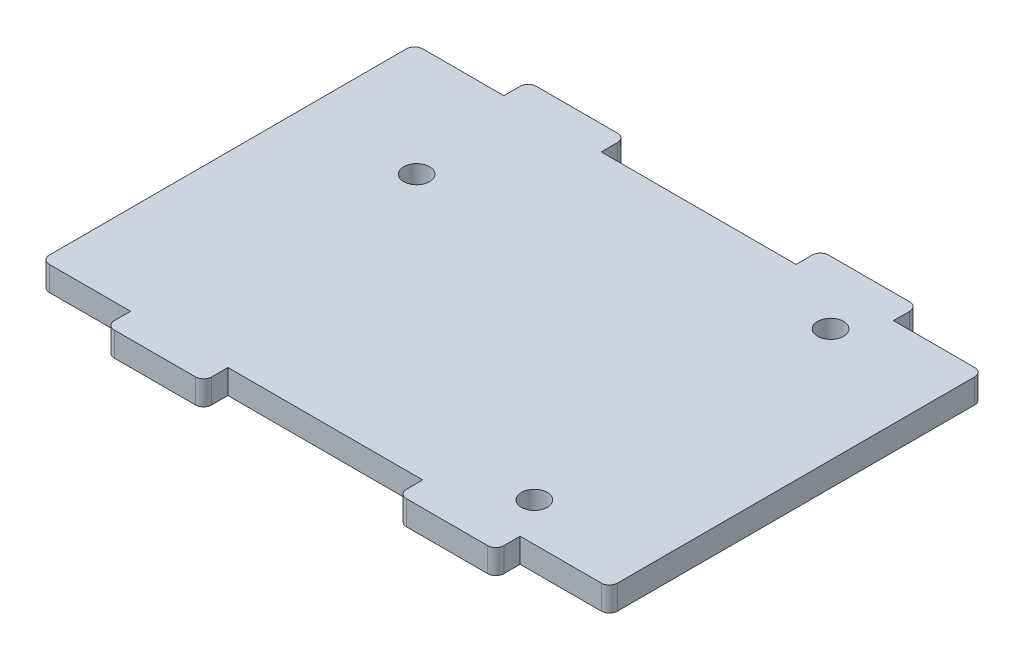
ISO-10303-21;
HEADER;
FILE_DESCRIPTION(('STEP AP214'),'2;1');
FILE_NAME('part.step','',(''),(''),'','','');
FILE_SCHEMA(('AUTOMOTIVE_DESIGN { 1 0 10303 214 1 1 1 1 }'));
ENDSEC;
DATA;
#1=APPLICATION_CONTEXT('core data for automotive mechanical design processes');
#2=APPLICATION_PROTOCOL_DEFINITION('international standard','automotive_design',2000,#1);
#3=PRODUCT_CONTEXT('',#1,'mechanical');
#4=PRODUCT('Part','Part','',(#3));
#5=PRODUCT_RELATED_PRODUCT_CATEGORY('part','',(#4));
#6=PRODUCT_DEFINITION_FORMATION('','',#4);
#7=PRODUCT_DEFINITION_CONTEXT('part definition',#1,'design');
#8=PRODUCT_DEFINITION('design','',#6,#7);
#9=PRODUCT_DEFINITION_SHAPE('','',#8);
#10=(LENGTH_UNIT() NAMED_UNIT(*) SI_UNIT(.MILLI.,.METRE.));
#11=(NAMED_UNIT(*) PLANE_ANGLE_UNIT() SI_UNIT($,.RADIAN.));
#12=(NAMED_UNIT(*) SI_UNIT($,.STERADIAN.) SOLID_ANGLE_UNIT());
#13=UNCERTAINTY_MEASURE_WITH_UNIT(LENGTH_MEASURE(1.E-05),#10,'distance_accuracy_value','');
#14=(GEOMETRIC_REPRESENTATION_CONTEXT(3) GLOBAL_UNCERTAINTY_ASSIGNED_CONTEXT((#13)) GLOBAL_UNIT_ASSIGNED_CONTEXT((#10,
#11,#12)) REPRESENTATION_CONTEXT('',''));
#15=CARTESIAN_POINT('',(0.,0.,0.));
#16=DIRECTION('',(0.,0.,1.));
#17=DIRECTION('',(1.,0.,0.));
#18=AXIS2_PLACEMENT_3D('',#15,#16,#17);
#19=CARTESIAN_POINT('',(-35.,3.,26.));
#20=DIRECTION('',(0.,0.,-1.));
#21=DIRECTION('',(-1.,0.,0.));
#22=AXIS2_PLACEMENT_3D('',#19,#20,#21);
#23=PLANE('',#22);
#24=DIRECTION('',(1.,0.,0.));
#25=VECTOR('',#24,1.);
#26=CARTESIAN_POINT('',(-35.,0.,26.));
#27=LINE('',#26,#25);
#28=CARTESIAN_POINT('',(-23.,0.,26.));
#29=VERTEX_POINT('',#28);
#30=CARTESIAN_POINT('',(-13.,0.,26.));
#31=VERTEX_POINT('',#30);
#32=EDGE_CURVE('E358',#29,#31,#27,.T.);
#33=ORIENTED_EDGE('',*,*,#32,.T.);
#34=DIRECTION('',(0.,1.,0.));
#35=VECTOR('',#34,1.);
#36=CARTESIAN_POINT('',(-13.,3.,26.));
#37=LINE('',#36,#35);
#38=CARTESIAN_POINT('',(-13.,3.,26.));
#39=VERTEX_POINT('',#38);
#40=EDGE_CURVE('E469',#31,#39,#37,.T.);
#41=ORIENTED_EDGE('',*,*,#40,.T.);
#42=DIRECTION('',(1.,0.,0.));
#43=VECTOR('',#42,1.);
#44=CARTESIAN_POINT('',(-35.,3.,26.));
#45=LINE('',#44,#43);
#46=CARTESIAN_POINT('',(-23.,3.,26.));
#47=VERTEX_POINT('',#46);
#48=EDGE_CURVE('E366',#47,#39,#45,.T.);
#49=ORIENTED_EDGE('',*,*,#48,.F.);
#50=DIRECTION('',(0.,1.,0.));
#51=VECTOR('',#50,1.);
#52=CARTESIAN_POINT('',(-23.,3.,26.));
#53=LINE('',#52,#51);
#54=EDGE_CURVE('E467',#47,#29,#53,.F.);
#55=ORIENTED_EDGE('',*,*,#54,.T.);
#56=EDGE_LOOP('',(#33,#41,#49,#55));
#57=FACE_BOUND('',#56,.T.);
#58=ADVANCED_FACE('F35',(#57),#23,.F.);
#59=CARTESIAN_POINT('',(-35.,3.,-26.));
#60=DIRECTION('',(0.,0.,1.));
#61=DIRECTION('',(1.,0.,0.));
#62=AXIS2_PLACEMENT_3D('',#59,#60,#61);
#63=PLANE('',#62);
#64=DIRECTION('',(-1.,0.,0.));
#65=VECTOR('',#64,1.);
#66=CARTESIAN_POINT('',(-35.,0.,-26.));
#67=LINE('',#66,#65);
#68=CARTESIAN_POINT('',(23.,0.,-26.));
#69=VERTEX_POINT('',#68);
#70=CARTESIAN_POINT('',(13.,0.,-26.));
#71=VERTEX_POINT('',#70);
#72=EDGE_CURVE('E372',#69,#71,#67,.T.);
#73=ORIENTED_EDGE('',*,*,#72,.T.);
#74=DIRECTION('',(0.,1.,0.));
#75=VECTOR('',#74,1.);
#76=CARTESIAN_POINT('',(13.,3.,-26.));
#77=LINE('',#76,#75);
#78=CARTESIAN_POINT('',(13.,3.,-26.));
#79=VERTEX_POINT('',#78);
#80=EDGE_CURVE('E439',#71,#79,#77,.T.);
#81=ORIENTED_EDGE('',*,*,#80,.T.);
#82=DIRECTION('',(-1.,0.,0.));
#83=VECTOR('',#82,1.);
#84=CARTESIAN_POINT('',(-35.,3.,-26.));
#85=LINE('',#84,#83);
#86=CARTESIAN_POINT('',(23.,3.,-26.));
#87=VERTEX_POINT('',#86);
#88=EDGE_CURVE('E359',#87,#79,#85,.T.);
#89=ORIENTED_EDGE('',*,*,#88,.F.);
#90=DIRECTION('',(0.,1.,0.));
#91=VECTOR('',#90,1.);
#92=CARTESIAN_POINT('',(23.,3.,-26.));
#93=LINE('',#92,#91);
#94=EDGE_CURVE('E437',#87,#69,#93,.F.);
#95=ORIENTED_EDGE('',*,*,#94,.T.);
#96=EDGE_LOOP('',(#73,#81,#89,#95));
#97=FACE_BOUND('',#96,.T.);
#98=ADVANCED_FACE('F531',(#97),#63,.F.);
#99=CARTESIAN_POINT('',(35.,3.,-26.));
#100=DIRECTION('',(-1.,0.,0.));
#101=DIRECTION('',(0.,0.,1.));
#102=AXIS2_PLACEMENT_3D('',#99,#100,#101);
#103=PLANE('',#102);
#104=DIRECTION('',(0.,0.,-1.));
#105=VECTOR('',#104,1.);
#106=CARTESIAN_POINT('',(35.,0.,-26.));
#107=LINE('',#106,#105);
#108=CARTESIAN_POINT('',(35.,0.,22.));
#109=VERTEX_POINT('',#108);
#110=CARTESIAN_POINT('',(35.,0.,-22.));
#111=VERTEX_POINT('',#110);
#112=EDGE_CURVE('E351',#109,#111,#107,.T.);
#113=ORIENTED_EDGE('',*,*,#112,.T.);
#114=DIRECTION('',(0.,1.,0.));
#115=VECTOR('',#114,1.);
#116=CARTESIAN_POINT('',(35.,3.,-22.));
#117=LINE('',#116,#115);
#118=CARTESIAN_POINT('',(35.,3.,-22.));
#119=VERTEX_POINT('',#118);
#120=EDGE_CURVE('E449',#111,#119,#117,.T.);
#121=ORIENTED_EDGE('',*,*,#120,.T.);
#122=DIRECTION('',(0.,0.,-1.));
#123=VECTOR('',#122,1.);
#124=CARTESIAN_POINT('',(35.,3.,-26.));
#125=LINE('',#124,#123);
#126=CARTESIAN_POINT('',(35.,3.,22.));
#127=VERTEX_POINT('',#126);
#128=EDGE_CURVE('E354',#127,#119,#125,.T.);
#129=ORIENTED_EDGE('',*,*,#128,.F.);
#130=DIRECTION('',(0.,1.,0.));
#131=VECTOR('',#130,1.);
#132=CARTESIAN_POINT('',(35.,3.,22.));
#133=LINE('',#132,#131);
#134=EDGE_CURVE('E447',#127,#109,#133,.F.);
#135=ORIENTED_EDGE('',*,*,#134,.T.);
#136=EDGE_LOOP('',(#113,#121,#129,#135));
#137=FACE_BOUND('',#136,.T.);
#138=ADVANCED_FACE('F553',(#137),#103,.F.);
#139=CARTESIAN_POINT('',(-13.,3.,-26.));
#140=VERTEX_POINT('',#139);
#141=CARTESIAN_POINT('',(-23.,3.,-26.));
#142=VERTEX_POINT('',#141);
#143=EDGE_CURVE('E357',#140,#142,#85,.T.);
#144=ORIENTED_EDGE('',*,*,#143,.F.);
#145=DIRECTION('',(0.,-1.,0.));
#146=VECTOR('',#145,1.);
#147=CARTESIAN_POINT('',(-13.,3.,-26.));
#148=LINE('',#147,#146);
#149=CARTESIAN_POINT('',(-13.,0.,-26.));
#150=VERTEX_POINT('',#149);
#151=EDGE_CURVE('E386',#140,#150,#148,.T.);
#152=ORIENTED_EDGE('',*,*,#151,.T.);
#153=CARTESIAN_POINT('',(-23.,0.,-26.));
#154=VERTEX_POINT('',#153);
#155=EDGE_CURVE('E371',#150,#154,#67,.T.);
#156=ORIENTED_EDGE('',*,*,#155,.T.);
#157=DIRECTION('',(0.,1.,0.));
#158=VECTOR('',#157,1.);
#159=CARTESIAN_POINT('',(-23.,3.,-26.));
#160=LINE('',#159,#158);
#161=EDGE_CURVE('E383',#154,#142,#160,.T.);
#162=ORIENTED_EDGE('',*,*,#161,.T.);
#163=EDGE_LOOP('',(#144,#152,#156,#162));
#164=FACE_BOUND('',#163,.T.);
#165=ADVANCED_FACE('F505',(#164),#63,.F.);
#166=CARTESIAN_POINT('',(-35.,3.,-26.));
#167=DIRECTION('',(1.,0.,0.));
#168=DIRECTION('',(0.,0.,-1.));
#169=AXIS2_PLACEMENT_3D('',#166,#167,#168);
#170=PLANE('',#169);
#171=DIRECTION('',(0.,0.,1.));
#172=VECTOR('',#171,1.);
#173=CARTESIAN_POINT('',(-35.,0.,-26.));
#174=LINE('',#173,#172);
#175=CARTESIAN_POINT('',(-35.,0.,-22.));
#176=VERTEX_POINT('',#175);
#177=CARTESIAN_POINT('',(-35.,0.,22.));
#178=VERTEX_POINT('',#177);
#179=EDGE_CURVE('E375',#176,#178,#174,.T.);
#180=ORIENTED_EDGE('',*,*,#179,.T.);
#181=DIRECTION('',(0.,1.,0.));
#182=VECTOR('',#181,1.);
#183=CARTESIAN_POINT('',(-35.,3.,22.));
#184=LINE('',#183,#182);
#185=CARTESIAN_POINT('',(-35.,3.,22.));
#186=VERTEX_POINT('',#185);
#187=EDGE_CURVE('E477',#178,#186,#184,.T.);
#188=ORIENTED_EDGE('',*,*,#187,.T.);
#189=DIRECTION('',(0.,0.,1.));
#190=VECTOR('',#189,1.);
#191=CARTESIAN_POINT('',(-35.,3.,-26.));
#192=LINE('',#191,#190);
#193=CARTESIAN_POINT('',(-35.,3.,-22.));
#194=VERTEX_POINT('',#193);
#195=EDGE_CURVE('E362',#194,#186,#192,.T.);
#196=ORIENTED_EDGE('',*,*,#195,.F.);
#197=DIRECTION('',(0.,1.,0.));
#198=VECTOR('',#197,1.);
#199=CARTESIAN_POINT('',(-35.,3.,-22.));
#200=LINE('',#199,#198);
#201=EDGE_CURVE('E475',#194,#176,#200,.F.);
#202=ORIENTED_EDGE('',*,*,#201,.T.);
#203=EDGE_LOOP('',(#180,#188,#196,#202));
#204=FACE_BOUND('',#203,.T.);
#205=ADVANCED_FACE('F610',(#204),#170,.F.);
#206=CARTESIAN_POINT('',(13.,0.,26.));
#207=VERTEX_POINT('',#206);
#208=CARTESIAN_POINT('',(23.,0.,26.));
#209=VERTEX_POINT('',#208);
#210=EDGE_CURVE('E378',#207,#209,#27,.T.);
#211=ORIENTED_EDGE('',*,*,#210,.T.);
#212=DIRECTION('',(0.,1.,0.));
#213=VECTOR('',#212,1.);
#214=CARTESIAN_POINT('',(23.,3.,26.));
#215=LINE('',#214,#213);
#216=CARTESIAN_POINT('',(23.,3.,26.));
#217=VERTEX_POINT('',#216);
#218=EDGE_CURVE('E460',#209,#217,#215,.T.);
#219=ORIENTED_EDGE('',*,*,#218,.T.);
#220=CARTESIAN_POINT('',(13.,3.,26.));
#221=VERTEX_POINT('',#220);
#222=EDGE_CURVE('E365',#221,#217,#45,.T.);
#223=ORIENTED_EDGE('',*,*,#222,.F.);
#224=DIRECTION('',(0.,-1.,0.));
#225=VECTOR('',#224,1.);
#226=CARTESIAN_POINT('',(13.,3.,26.));
#227=LINE('',#226,#225);
#228=EDGE_CURVE('E457',#221,#207,#227,.T.);
#229=ORIENTED_EDGE('',*,*,#228,.T.);
#230=EDGE_LOOP('',(#211,#219,#223,#229));
#231=FACE_BOUND('',#230,.T.);
#232=ADVANCED_FACE('F577',(#231),#23,.F.);
#233=CARTESIAN_POINT('',(0.,3.,0.));
#234=DIRECTION('',(0.,1.,0.));
#235=DIRECTION('',(0.,0.,1.));
#236=AXIS2_PLACEMENT_3D('',#233,#234,#235);
#237=PLANE('',#236);
#238=CARTESIAN_POINT('',(21.,3.,18.25));
#239=DIRECTION('',(0.,1.,0.));
#240=DIRECTION('',(0.,0.,1.));
#241=AXIS2_PLACEMENT_3D('',#238,#239,#240);
#242=CIRCLE('',#241,1.6);
#243=CARTESIAN_POINT('',(21.,3.,19.85));
#244=VERTEX_POINT('',#243);
#245=EDGE_CURVE('E930',#244,#244,#242,.T.);
#246=ORIENTED_EDGE('',*,*,#245,.F.);
#247=EDGE_LOOP('',(#246));
#248=FACE_BOUND('',#247,.T.);
#249=CARTESIAN_POINT('',(21.,3.,-18.25));
#250=DIRECTION('',(0.,1.,0.));
#251=DIRECTION('',(0.,0.,1.));
#252=AXIS2_PLACEMENT_3D('',#249,#250,#251);
#253=CIRCLE('',#252,1.6);
#254=CARTESIAN_POINT('',(21.,3.,-16.65));
#255=VERTEX_POINT('',#254);
#256=EDGE_CURVE('E926',#255,#255,#253,.T.);
#257=ORIENTED_EDGE('',*,*,#256,.F.);
#258=EDGE_LOOP('',(#257));
#259=FACE_BOUND('',#258,.T.);
#260=CARTESIAN_POINT('',(-21.,3.,-9.25000000000002));
#261=DIRECTION('',(0.,1.,0.));
#262=DIRECTION('',(0.,0.,1.));
#263=AXIS2_PLACEMENT_3D('',#260,#261,#262);
#264=CIRCLE('',#263,1.6);
#265=CARTESIAN_POINT('',(-21.,3.,-7.65000000000002));
#266=VERTEX_POINT('',#265);
#267=EDGE_CURVE('E275',#266,#266,#264,.T.);
#268=ORIENTED_EDGE('',*,*,#267,.F.);
#269=EDGE_LOOP('',(#268));
#270=FACE_BOUND('',#269,.T.);
#271=DIRECTION('',(0.,0.,1.));
#272=VECTOR('',#271,1.);
#273=CARTESIAN_POINT('',(-12.,3.,-29.));
#274=LINE('',#273,#272);
#275=CARTESIAN_POINT('',(-12.,3.,-25.));
#276=VERTEX_POINT('',#275);
#277=CARTESIAN_POINT('',(-12.,3.,-23.));
#278=VERTEX_POINT('',#277);
#279=EDGE_CURVE('E345',#276,#278,#274,.T.);
#280=ORIENTED_EDGE('',*,*,#279,.F.);
#281=CARTESIAN_POINT('',(-13.,3.,-25.));
#282=DIRECTION('',(0.,1.,0.));
#283=DIRECTION('',(0.,0.,1.));
#284=AXIS2_PLACEMENT_3D('',#281,#282,#283);
#285=CIRCLE('',#284,1.);
#286=EDGE_CURVE('E435',#276,#140,#285,.T.);
#287=ORIENTED_EDGE('',*,*,#286,.T.);
#288=ORIENTED_EDGE('',*,*,#143,.T.);
#289=CARTESIAN_POINT('',(-23.,3.,-25.));
#290=DIRECTION('',(0.,1.,0.));
#291=DIRECTION('',(0.,0.,1.));
#292=AXIS2_PLACEMENT_3D('',#289,#290,#291);
#293=CIRCLE('',#292,1.);
#294=CARTESIAN_POINT('',(-24.,3.,-25.));
#295=VERTEX_POINT('',#294);
#296=EDGE_CURVE('E415',#142,#295,#293,.T.);
#297=ORIENTED_EDGE('',*,*,#296,.T.);
#298=DIRECTION('',(0.,0.,-1.));
#299=VECTOR('',#298,1.);
#300=CARTESIAN_POINT('',(-24.,3.,-26.));
#301=LINE('',#300,#299);
#302=CARTESIAN_POINT('',(-24.,3.,-23.));
#303=VERTEX_POINT('',#302);
#304=EDGE_CURVE('E325',#303,#295,#301,.T.);
#305=ORIENTED_EDGE('',*,*,#304,.F.);
#306=DIRECTION('',(1.,0.,0.));
#307=VECTOR('',#306,1.);
#308=CARTESIAN_POINT('',(-24.,3.,-23.));
#309=LINE('',#308,#307);
#310=CARTESIAN_POINT('',(-34.,3.,-23.));
#311=VERTEX_POINT('',#310);
#312=EDGE_CURVE('E321',#311,#303,#309,.T.);
#313=ORIENTED_EDGE('',*,*,#312,.F.);
#314=CARTESIAN_POINT('',(-34.,3.,-22.));
#315=DIRECTION('',(0.,1.,0.));
#316=DIRECTION('',(0.,0.,1.));
#317=AXIS2_PLACEMENT_3D('',#314,#315,#316);
#318=CIRCLE('',#317,1.);
#319=EDGE_CURVE('E417',#311,#194,#318,.T.);
#320=ORIENTED_EDGE('',*,*,#319,.T.);
#321=ORIENTED_EDGE('',*,*,#195,.T.);
#322=CARTESIAN_POINT('',(-34.,3.,22.));
#323=DIRECTION('',(0.,1.,0.));
#324=DIRECTION('',(0.,0.,1.));
#325=AXIS2_PLACEMENT_3D('',#322,#323,#324);
#326=CIRCLE('',#325,1.);
#327=CARTESIAN_POINT('',(-34.,3.,23.));
#328=VERTEX_POINT('',#327);
#329=EDGE_CURVE('E419',#186,#328,#326,.T.);
#330=ORIENTED_EDGE('',*,*,#329,.T.);
#331=DIRECTION('',(-1.,0.,0.));
#332=VECTOR('',#331,1.);
#333=CARTESIAN_POINT('',(-24.,3.,23.));
#334=LINE('',#333,#332);
#335=CARTESIAN_POINT('',(-24.,3.,23.));
#336=VERTEX_POINT('',#335);
#337=EDGE_CURVE('E295',#336,#328,#334,.T.);
#338=ORIENTED_EDGE('',*,*,#337,.F.);
#339=DIRECTION('',(0.,0.,-1.));
#340=VECTOR('',#339,1.);
#341=CARTESIAN_POINT('',(-24.,3.,26.));
#342=LINE('',#341,#340);
#343=CARTESIAN_POINT('',(-24.,3.,25.));
#344=VERTEX_POINT('',#343);
#345=EDGE_CURVE('E300',#344,#336,#342,.T.);
#346=ORIENTED_EDGE('',*,*,#345,.F.);
#347=CARTESIAN_POINT('',(-23.,3.,25.));
#348=DIRECTION('',(0.,1.,0.));
#349=DIRECTION('',(0.,0.,1.));
#350=AXIS2_PLACEMENT_3D('',#347,#348,#349);
#351=CIRCLE('',#350,1.);
#352=EDGE_CURVE('E58',#344,#47,#351,.T.);
#353=ORIENTED_EDGE('',*,*,#352,.T.);
#354=ORIENTED_EDGE('',*,*,#48,.T.);
#355=CARTESIAN_POINT('',(-13.,3.,25.));
#356=DIRECTION('',(0.,1.,0.));
#357=DIRECTION('',(0.,0.,1.));
#358=AXIS2_PLACEMENT_3D('',#355,#356,#357);
#359=CIRCLE('',#358,1.);
#360=CARTESIAN_POINT('',(-12.,3.,25.));
#361=VERTEX_POINT('',#360);
#362=EDGE_CURVE('E50',#39,#361,#359,.T.);
#363=ORIENTED_EDGE('',*,*,#362,.T.);
#364=DIRECTION('',(0.,0.,1.));
#365=VECTOR('',#364,1.);
#366=CARTESIAN_POINT('',(-12.,3.,29.));
#367=LINE('',#366,#365);
#368=CARTESIAN_POINT('',(-12.,3.,23.));
#369=VERTEX_POINT('',#368);
#370=EDGE_CURVE('E271',#369,#361,#367,.T.);
#371=ORIENTED_EDGE('',*,*,#370,.F.);
#372=DIRECTION('',(-1.,0.,0.));
#373=VECTOR('',#372,1.);
#374=CARTESIAN_POINT('',(-12.,3.,23.));
#375=LINE('',#374,#373);
#376=CARTESIAN_POINT('',(12.,3.,23.));
#377=VERTEX_POINT('',#376);
#378=EDGE_CURVE('E253',#377,#369,#375,.T.);
#379=ORIENTED_EDGE('',*,*,#378,.F.);
#380=DIRECTION('',(0.,0.,-1.));
#381=VECTOR('',#380,1.);
#382=CARTESIAN_POINT('',(12.,3.,29.));
#383=LINE('',#382,#381);
#384=CARTESIAN_POINT('',(12.,3.,25.));
#385=VERTEX_POINT('',#384);
#386=EDGE_CURVE('E278',#385,#377,#383,.T.);
#387=ORIENTED_EDGE('',*,*,#386,.F.);
#388=CARTESIAN_POINT('',(13.,3.,25.));
#389=DIRECTION('',(0.,1.,0.));
#390=DIRECTION('',(0.,0.,1.));
#391=AXIS2_PLACEMENT_3D('',#388,#389,#390);
#392=CIRCLE('',#391,1.);
#393=EDGE_CURVE('E423',#385,#221,#392,.T.);
#394=ORIENTED_EDGE('',*,*,#393,.T.);
#395=ORIENTED_EDGE('',*,*,#222,.T.);
#396=CARTESIAN_POINT('',(23.,3.,25.));
#397=DIRECTION('',(0.,1.,0.));
#398=DIRECTION('',(0.,0.,1.));
#399=AXIS2_PLACEMENT_3D('',#396,#397,#398);
#400=CIRCLE('',#399,1.);
#401=CARTESIAN_POINT('',(24.,3.,25.));
#402=VERTEX_POINT('',#401);
#403=EDGE_CURVE('E425',#217,#402,#400,.T.);
#404=ORIENTED_EDGE('',*,*,#403,.T.);
#405=DIRECTION('',(0.,0.,1.));
#406=VECTOR('',#405,1.);
#407=CARTESIAN_POINT('',(24.,3.,26.));
#408=LINE('',#407,#406);
#409=CARTESIAN_POINT('',(24.,3.,23.));
#410=VERTEX_POINT('',#409);
#411=EDGE_CURVE('E286',#410,#402,#408,.T.);
#412=ORIENTED_EDGE('',*,*,#411,.F.);
#413=DIRECTION('',(-1.,0.,0.));
#414=VECTOR('',#413,1.);
#415=CARTESIAN_POINT('',(24.,3.,23.));
#416=LINE('',#415,#414);
#417=CARTESIAN_POINT('',(34.,3.,23.));
#418=VERTEX_POINT('',#417);
#419=EDGE_CURVE('E257',#418,#410,#416,.T.);
#420=ORIENTED_EDGE('',*,*,#419,.F.);
#421=CARTESIAN_POINT('',(34.,3.,22.));
#422=DIRECTION('',(0.,1.,0.));
#423=DIRECTION('',(0.,0.,1.));
#424=AXIS2_PLACEMENT_3D('',#421,#422,#423);
#425=CIRCLE('',#424,1.);
#426=EDGE_CURVE('E427',#418,#127,#425,.T.);
#427=ORIENTED_EDGE('',*,*,#426,.T.);
#428=ORIENTED_EDGE('',*,*,#128,.T.);
#429=CARTESIAN_POINT('',(34.,3.,-22.));
#430=DIRECTION('',(0.,1.,0.));
#431=DIRECTION('',(0.,0.,1.));
#432=AXIS2_PLACEMENT_3D('',#429,#430,#431);
#433=CIRCLE('',#432,1.);
#434=CARTESIAN_POINT('',(34.,3.,-23.));
#435=VERTEX_POINT('',#434);
#436=EDGE_CURVE('E429',#119,#435,#433,.T.);
#437=ORIENTED_EDGE('',*,*,#436,.T.);
#438=DIRECTION('',(1.,0.,0.));
#439=VECTOR('',#438,1.);
#440=CARTESIAN_POINT('',(24.,3.,-23.));
#441=LINE('',#440,#439);
#442=CARTESIAN_POINT('',(24.,3.,-23.));
#443=VERTEX_POINT('',#442);
#444=EDGE_CURVE('E312',#443,#435,#441,.T.);
#445=ORIENTED_EDGE('',*,*,#444,.F.);
#446=DIRECTION('',(0.,0.,1.));
#447=VECTOR('',#446,1.);
#448=CARTESIAN_POINT('',(24.,3.,-26.));
#449=LINE('',#448,#447);
#450=CARTESIAN_POINT('',(24.,3.,-25.));
#451=VERTEX_POINT('',#450);
#452=EDGE_CURVE('E308',#451,#443,#449,.T.);
#453=ORIENTED_EDGE('',*,*,#452,.F.);
#454=CARTESIAN_POINT('',(23.,3.,-25.));
#455=DIRECTION('',(0.,1.,0.));
#456=DIRECTION('',(0.,0.,1.));
#457=AXIS2_PLACEMENT_3D('',#454,#455,#456);
#458=CIRCLE('',#457,1.);
#459=EDGE_CURVE('E431',#451,#87,#458,.T.);
#460=ORIENTED_EDGE('',*,*,#459,.T.);
#461=ORIENTED_EDGE('',*,*,#88,.T.);
#462=CARTESIAN_POINT('',(13.,3.,-25.));
#463=DIRECTION('',(0.,1.,0.));
#464=DIRECTION('',(0.,0.,1.));
#465=AXIS2_PLACEMENT_3D('',#462,#463,#464);
#466=CIRCLE('',#465,1.);
#467=CARTESIAN_POINT('',(12.,3.,-25.));
#468=VERTEX_POINT('',#467);
#469=EDGE_CURVE('E433',#79,#468,#466,.T.);
#470=ORIENTED_EDGE('',*,*,#469,.T.);
#471=DIRECTION('',(0.,0.,-1.));
#472=VECTOR('',#471,1.);
#473=CARTESIAN_POINT('',(12.,3.,-29.));
#474=LINE('',#473,#472);
#475=CARTESIAN_POINT('',(12.,3.,-23.));
#476=VERTEX_POINT('',#475);
#477=EDGE_CURVE('E334',#476,#468,#474,.T.);
#478=ORIENTED_EDGE('',*,*,#477,.F.);
#479=DIRECTION('',(1.,0.,0.));
#480=VECTOR('',#479,1.);
#481=CARTESIAN_POINT('',(-12.,3.,-23.));
#482=LINE('',#481,#480);
#483=EDGE_CURVE('E339',#278,#476,#482,.T.);
#484=ORIENTED_EDGE('',*,*,#483,.F.);
#485=EDGE_LOOP('',(#280,#287,#288,#297,#305,#313,#320,#321,#330,#338,#346,#353,#354,#363,#371,
#379,#387,#394,#395,#404,#412,#420,#427,#428,#437,#445,#453,#460,#461,#470,#478,#484));
#486=FACE_BOUND('',#485,.T.);
#487=ADVANCED_FACE('F492',(#248,#259,#270,#486),#237,.T.);
#488=CARTESIAN_POINT('',(0.,0.,0.));
#489=DIRECTION('',(0.,1.,0.));
#490=DIRECTION('',(0.,0.,1.));
#491=AXIS2_PLACEMENT_3D('',#488,#489,#490);
#492=PLANE('',#491);
#493=CARTESIAN_POINT('',(21.,0.,18.25));
#494=DIRECTION('',(0.,1.,0.));
#495=DIRECTION('',(0.,0.,1.));
#496=AXIS2_PLACEMENT_3D('',#493,#494,#495);
#497=CIRCLE('',#496,1.6);
#498=CARTESIAN_POINT('',(21.,0.,19.85));
#499=VERTEX_POINT('',#498);
#500=EDGE_CURVE('E917',#499,#499,#497,.T.);
#501=ORIENTED_EDGE('',*,*,#500,.T.);
#502=EDGE_LOOP('',(#501));
#503=FACE_BOUND('',#502,.T.);
#504=CARTESIAN_POINT('',(21.,0.,-18.25));
#505=DIRECTION('',(0.,1.,0.));
#506=DIRECTION('',(0.,0.,1.));
#507=AXIS2_PLACEMENT_3D('',#504,#505,#506);
#508=CIRCLE('',#507,1.6);
#509=CARTESIAN_POINT('',(21.,0.,-16.65));
#510=VERTEX_POINT('',#509);
#511=EDGE_CURVE('E921',#510,#510,#508,.T.);
#512=ORIENTED_EDGE('',*,*,#511,.T.);
#513=EDGE_LOOP('',(#512));
#514=FACE_BOUND('',#513,.T.);
#515=CARTESIAN_POINT('',(-21.,0.,-9.25000000000002));
#516=DIRECTION('',(0.,1.,0.));
#517=DIRECTION('',(0.,0.,1.));
#518=AXIS2_PLACEMENT_3D('',#515,#516,#517);
#519=CIRCLE('',#518,1.6);
#520=CARTESIAN_POINT('',(-21.,0.,-7.65000000000002));
#521=VERTEX_POINT('',#520);
#522=EDGE_CURVE('E280',#521,#521,#519,.T.);
#523=ORIENTED_EDGE('',*,*,#522,.T.);
#524=EDGE_LOOP('',(#523));
#525=FACE_BOUND('',#524,.T.);
#526=ORIENTED_EDGE('',*,*,#155,.F.);
#527=CARTESIAN_POINT('',(-13.,0.,-25.));
#528=DIRECTION('',(0.,1.,0.));
#529=DIRECTION('',(0.,0.,1.));
#530=AXIS2_PLACEMENT_3D('',#527,#528,#529);
#531=CIRCLE('',#530,1.);
#532=CARTESIAN_POINT('',(-12.,0.,-25.));
#533=VERTEX_POINT('',#532);
#534=EDGE_CURVE('E411',#150,#533,#531,.F.);
#535=ORIENTED_EDGE('',*,*,#534,.T.);
#536=DIRECTION('',(0.,0.,1.));
#537=VECTOR('',#536,1.);
#538=CARTESIAN_POINT('',(-12.,0.,0.));
#539=LINE('',#538,#537);
#540=CARTESIAN_POINT('',(-12.,0.,-23.));
#541=VERTEX_POINT('',#540);
#542=EDGE_CURVE('E368',#533,#541,#539,.T.);
#543=ORIENTED_EDGE('',*,*,#542,.T.);
#544=DIRECTION('',(1.,0.,0.));
#545=VECTOR('',#544,1.);
#546=CARTESIAN_POINT('',(-12.,0.,-23.));
#547=LINE('',#546,#545);
#548=CARTESIAN_POINT('',(12.,0.,-23.));
#549=VERTEX_POINT('',#548);
#550=EDGE_CURVE('E338',#541,#549,#547,.T.);
#551=ORIENTED_EDGE('',*,*,#550,.T.);
#552=DIRECTION('',(0.,0.,-1.));
#553=VECTOR('',#552,1.);
#554=CARTESIAN_POINT('',(12.,0.,-29.));
#555=LINE('',#554,#553);
#556=CARTESIAN_POINT('',(12.,0.,-25.));
#557=VERTEX_POINT('',#556);
#558=EDGE_CURVE('E335',#549,#557,#555,.T.);
#559=ORIENTED_EDGE('',*,*,#558,.T.);
#560=CARTESIAN_POINT('',(13.,0.,-25.));
#561=DIRECTION('',(0.,1.,0.));
#562=DIRECTION('',(0.,0.,1.));
#563=AXIS2_PLACEMENT_3D('',#560,#561,#562);
#564=CIRCLE('',#563,1.);
#565=EDGE_CURVE('E409',#557,#71,#564,.F.);
#566=ORIENTED_EDGE('',*,*,#565,.T.);
#567=ORIENTED_EDGE('',*,*,#72,.F.);
#568=CARTESIAN_POINT('',(23.,0.,-25.));
#569=DIRECTION('',(0.,1.,0.));
#570=DIRECTION('',(0.,0.,1.));
#571=AXIS2_PLACEMENT_3D('',#568,#569,#570);
#572=CIRCLE('',#571,1.);
#573=CARTESIAN_POINT('',(24.,0.,-25.));
#574=VERTEX_POINT('',#573);
#575=EDGE_CURVE('E407',#69,#574,#572,.F.);
#576=ORIENTED_EDGE('',*,*,#575,.T.);
#577=DIRECTION('',(0.,0.,1.));
#578=VECTOR('',#577,1.);
#579=CARTESIAN_POINT('',(24.,0.,-26.));
#580=LINE('',#579,#578);
#581=CARTESIAN_POINT('',(24.,0.,-23.));
#582=VERTEX_POINT('',#581);
#583=EDGE_CURVE('E309',#574,#582,#580,.T.);
#584=ORIENTED_EDGE('',*,*,#583,.T.);
#585=DIRECTION('',(1.,0.,0.));
#586=VECTOR('',#585,1.);
#587=CARTESIAN_POINT('',(24.,0.,-23.));
#588=LINE('',#587,#586);
#589=CARTESIAN_POINT('',(34.,0.,-23.));
#590=VERTEX_POINT('',#589);
#591=EDGE_CURVE('E311',#582,#590,#588,.T.);
#592=ORIENTED_EDGE('',*,*,#591,.T.);
#593=CARTESIAN_POINT('',(34.,0.,-22.));
#594=DIRECTION('',(0.,1.,0.));
#595=DIRECTION('',(0.,0.,1.));
#596=AXIS2_PLACEMENT_3D('',#593,#594,#595);
#597=CIRCLE('',#596,1.);
#598=EDGE_CURVE('E405',#590,#111,#597,.F.);
#599=ORIENTED_EDGE('',*,*,#598,.T.);
#600=ORIENTED_EDGE('',*,*,#112,.F.);
#601=CARTESIAN_POINT('',(34.,0.,22.));
#602=DIRECTION('',(0.,1.,0.));
#603=DIRECTION('',(0.,0.,1.));
#604=AXIS2_PLACEMENT_3D('',#601,#602,#603);
#605=CIRCLE('',#604,1.);
#606=CARTESIAN_POINT('',(34.,0.,23.));
#607=VERTEX_POINT('',#606);
#608=EDGE_CURVE('E403',#109,#607,#605,.F.);
#609=ORIENTED_EDGE('',*,*,#608,.T.);
#610=DIRECTION('',(-1.,0.,0.));
#611=VECTOR('',#610,1.);
#612=CARTESIAN_POINT('',(24.,0.,23.));
#613=LINE('',#612,#611);
#614=CARTESIAN_POINT('',(24.,0.,23.));
#615=VERTEX_POINT('',#614);
#616=EDGE_CURVE('E283',#607,#615,#613,.T.);
#617=ORIENTED_EDGE('',*,*,#616,.T.);
#618=DIRECTION('',(0.,0.,1.));
#619=VECTOR('',#618,1.);
#620=CARTESIAN_POINT('',(24.,0.,26.));
#621=LINE('',#620,#619);
#622=CARTESIAN_POINT('',(24.,0.,25.));
#623=VERTEX_POINT('',#622);
#624=EDGE_CURVE('E285',#615,#623,#621,.T.);
#625=ORIENTED_EDGE('',*,*,#624,.T.);
#626=CARTESIAN_POINT('',(23.,0.,25.));
#627=DIRECTION('',(0.,1.,0.));
#628=DIRECTION('',(0.,0.,1.));
#629=AXIS2_PLACEMENT_3D('',#626,#627,#628);
#630=CIRCLE('',#629,1.);
#631=EDGE_CURVE('E401',#623,#209,#630,.F.);
#632=ORIENTED_EDGE('',*,*,#631,.T.);
#633=ORIENTED_EDGE('',*,*,#210,.F.);
#634=CARTESIAN_POINT('',(13.,0.,25.));
#635=DIRECTION('',(0.,1.,0.));
#636=DIRECTION('',(0.,0.,1.));
#637=AXIS2_PLACEMENT_3D('',#634,#635,#636);
#638=CIRCLE('',#637,1.);
#639=CARTESIAN_POINT('',(12.,0.,25.));
#640=VERTEX_POINT('',#639);
#641=EDGE_CURVE('E399',#207,#640,#638,.F.);
#642=ORIENTED_EDGE('',*,*,#641,.T.);
#643=DIRECTION('',(0.,0.,-1.));
#644=VECTOR('',#643,1.);
#645=CARTESIAN_POINT('',(12.,0.,0.));
#646=LINE('',#645,#644);
#647=CARTESIAN_POINT('',(12.,0.,23.));
#648=VERTEX_POINT('',#647);
#649=EDGE_CURVE('E270',#640,#648,#646,.T.);
#650=ORIENTED_EDGE('',*,*,#649,.T.);
#651=DIRECTION('',(-1.,0.,0.));
#652=VECTOR('',#651,1.);
#653=CARTESIAN_POINT('',(-12.,0.,23.));
#654=LINE('',#653,#652);
#655=CARTESIAN_POINT('',(-12.,0.,23.));
#656=VERTEX_POINT('',#655);
#657=EDGE_CURVE('E250',#648,#656,#654,.T.);
#658=ORIENTED_EDGE('',*,*,#657,.T.);
#659=DIRECTION('',(0.,0.,1.));
#660=VECTOR('',#659,1.);
#661=CARTESIAN_POINT('',(-12.,0.,29.));
#662=LINE('',#661,#660);
#663=CARTESIAN_POINT('',(-12.,0.,25.));
#664=VERTEX_POINT('',#663);
#665=EDGE_CURVE('E261',#656,#664,#662,.T.);
#666=ORIENTED_EDGE('',*,*,#665,.T.);
#667=CARTESIAN_POINT('',(-13.,0.,25.));
#668=DIRECTION('',(0.,1.,0.));
#669=DIRECTION('',(0.,0.,1.));
#670=AXIS2_PLACEMENT_3D('',#667,#668,#669);
#671=CIRCLE('',#670,1.);
#672=EDGE_CURVE('E397',#664,#31,#671,.F.);
#673=ORIENTED_EDGE('',*,*,#672,.T.);
#674=ORIENTED_EDGE('',*,*,#32,.F.);
#675=CARTESIAN_POINT('',(-23.,0.,25.));
#676=DIRECTION('',(0.,1.,0.));
#677=DIRECTION('',(0.,0.,1.));
#678=AXIS2_PLACEMENT_3D('',#675,#676,#677);
#679=CIRCLE('',#678,1.);
#680=CARTESIAN_POINT('',(-24.,0.,25.));
#681=VERTEX_POINT('',#680);
#682=EDGE_CURVE('E395',#29,#681,#679,.F.);
#683=ORIENTED_EDGE('',*,*,#682,.T.);
#684=DIRECTION('',(0.,0.,-1.));
#685=VECTOR('',#684,1.);
#686=CARTESIAN_POINT('',(-24.,0.,26.));
#687=LINE('',#686,#685);
#688=CARTESIAN_POINT('',(-24.,0.,23.));
#689=VERTEX_POINT('',#688);
#690=EDGE_CURVE('E299',#681,#689,#687,.T.);
#691=ORIENTED_EDGE('',*,*,#690,.T.);
#692=DIRECTION('',(-1.,0.,0.));
#693=VECTOR('',#692,1.);
#694=CARTESIAN_POINT('',(-24.,0.,23.));
#695=LINE('',#694,#693);
#696=CARTESIAN_POINT('',(-34.,0.,23.));
#697=VERTEX_POINT('',#696);
#698=EDGE_CURVE('E296',#689,#697,#695,.T.);
#699=ORIENTED_EDGE('',*,*,#698,.T.);
#700=CARTESIAN_POINT('',(-34.,0.,22.));
#701=DIRECTION('',(0.,1.,0.));
#702=DIRECTION('',(0.,0.,1.));
#703=AXIS2_PLACEMENT_3D('',#700,#701,#702);
#704=CIRCLE('',#703,1.);
#705=EDGE_CURVE('E393',#697,#178,#704,.F.);
#706=ORIENTED_EDGE('',*,*,#705,.T.);
#707=ORIENTED_EDGE('',*,*,#179,.F.);
#708=CARTESIAN_POINT('',(-34.,0.,-22.));
#709=DIRECTION('',(0.,1.,0.));
#710=DIRECTION('',(0.,0.,1.));
#711=AXIS2_PLACEMENT_3D('',#708,#709,#710);
#712=CIRCLE('',#711,1.);
#713=CARTESIAN_POINT('',(-34.,0.,-23.));
#714=VERTEX_POINT('',#713);
#715=EDGE_CURVE('E391',#176,#714,#712,.F.);
#716=ORIENTED_EDGE('',*,*,#715,.T.);
#717=DIRECTION('',(1.,0.,0.));
#718=VECTOR('',#717,1.);
#719=CARTESIAN_POINT('',(-24.,0.,-23.));
#720=LINE('',#719,#718);
#721=CARTESIAN_POINT('',(-24.,0.,-23.));
#722=VERTEX_POINT('',#721);
#723=EDGE_CURVE('E322',#714,#722,#720,.T.);
#724=ORIENTED_EDGE('',*,*,#723,.T.);
#725=DIRECTION('',(0.,0.,-1.));
#726=VECTOR('',#725,1.);
#727=CARTESIAN_POINT('',(-24.,0.,-26.));
#728=LINE('',#727,#726);
#729=CARTESIAN_POINT('',(-24.,0.,-25.));
#730=VERTEX_POINT('',#729);
#731=EDGE_CURVE('E324',#722,#730,#728,.T.);
#732=ORIENTED_EDGE('',*,*,#731,.T.);
#733=CARTESIAN_POINT('',(-23.,0.,-25.));
#734=DIRECTION('',(0.,1.,0.));
#735=DIRECTION('',(0.,0.,1.));
#736=AXIS2_PLACEMENT_3D('',#733,#734,#735);
#737=CIRCLE('',#736,1.);
#738=EDGE_CURVE('E389',#730,#154,#737,.F.);
#739=ORIENTED_EDGE('',*,*,#738,.T.);
#740=EDGE_LOOP('',(#526,#535,#543,#551,#559,#566,#567,#576,#584,#592,#599,#600,#609,#617,#625,
#632,#633,#642,#650,#658,#666,#673,#674,#683,#691,#699,#706,#707,#716,#724,#732,#739));
#741=FACE_BOUND('',#740,.T.);
#742=ADVANCED_FACE('F268',(#503,#514,#525,#741),#492,.F.);
#743=CARTESIAN_POINT('',(12.,0.,-29.));
#744=DIRECTION('',(1.,0.,0.));
#745=DIRECTION('',(0.,0.,-1.));
#746=AXIS2_PLACEMENT_3D('',#743,#744,#745);
#747=PLANE('',#746);
#748=ORIENTED_EDGE('',*,*,#477,.T.);
#749=DIRECTION('',(0.,1.,0.));
#750=VECTOR('',#749,1.);
#751=CARTESIAN_POINT('',(12.,0.,-25.));
#752=LINE('',#751,#750);
#753=EDGE_CURVE('E442',#468,#557,#752,.F.);
#754=ORIENTED_EDGE('',*,*,#753,.T.);
#755=ORIENTED_EDGE('',*,*,#558,.F.);
#756=DIRECTION('',(0.,1.,0.));
#757=VECTOR('',#756,1.);
#758=CARTESIAN_POINT('',(12.,0.,-23.));
#759=LINE('',#758,#757);
#760=EDGE_CURVE('E349',#549,#476,#759,.T.);
#761=ORIENTED_EDGE('',*,*,#760,.T.);
#762=EDGE_LOOP('',(#748,#754,#755,#761));
#763=FACE_BOUND('',#762,.T.);
#764=ADVANCED_FACE('F522',(#763),#747,.F.);
#765=CARTESIAN_POINT('',(-12.,0.,-29.));
#766=DIRECTION('',(-1.,0.,0.));
#767=DIRECTION('',(0.,0.,1.));
#768=AXIS2_PLACEMENT_3D('',#765,#766,#767);
#769=PLANE('',#768);
#770=ORIENTED_EDGE('',*,*,#542,.F.);
#771=DIRECTION('',(0.,-1.,0.));
#772=VECTOR('',#771,1.);
#773=CARTESIAN_POINT('',(-12.,0.,-25.));
#774=LINE('',#773,#772);
#775=EDGE_CURVE('E413',#533,#276,#774,.F.);
#776=ORIENTED_EDGE('',*,*,#775,.T.);
#777=ORIENTED_EDGE('',*,*,#279,.T.);
#778=DIRECTION('',(0.,1.,0.));
#779=VECTOR('',#778,1.);
#780=CARTESIAN_POINT('',(-12.,0.,-23.));
#781=LINE('',#780,#779);
#782=EDGE_CURVE('E342',#541,#278,#781,.T.);
#783=ORIENTED_EDGE('',*,*,#782,.F.);
#784=EDGE_LOOP('',(#770,#776,#777,#783));
#785=FACE_BOUND('',#784,.T.);
#786=ADVANCED_FACE('F515',(#785),#769,.F.);
#787=CARTESIAN_POINT('',(-12.,0.,-23.));
#788=DIRECTION('',(0.,0.,1.));
#789=DIRECTION('',(1.,0.,0.));
#790=AXIS2_PLACEMENT_3D('',#787,#788,#789);
#791=PLANE('',#790);
#792=ORIENTED_EDGE('',*,*,#483,.T.);
#793=ORIENTED_EDGE('',*,*,#760,.F.);
#794=ORIENTED_EDGE('',*,*,#550,.F.);
#795=ORIENTED_EDGE('',*,*,#782,.T.);
#796=EDGE_LOOP('',(#792,#793,#794,#795));
#797=FACE_BOUND('',#796,.T.);
#798=ADVANCED_FACE('F518',(#797),#791,.F.);
#799=CARTESIAN_POINT('',(-24.,0.,-26.));
#800=DIRECTION('',(1.,0.,0.));
#801=DIRECTION('',(0.,0.,-1.));
#802=AXIS2_PLACEMENT_3D('',#799,#800,#801);
#803=PLANE('',#802);
#804=ORIENTED_EDGE('',*,*,#304,.T.);
#805=DIRECTION('',(0.,1.,0.));
#806=VECTOR('',#805,1.);
#807=CARTESIAN_POINT('',(-24.,0.,-25.));
#808=LINE('',#807,#806);
#809=EDGE_CURVE('E11',#295,#730,#808,.F.);
#810=ORIENTED_EDGE('',*,*,#809,.T.);
#811=ORIENTED_EDGE('',*,*,#731,.F.);
#812=DIRECTION('',(0.,1.,0.));
#813=VECTOR('',#812,1.);
#814=CARTESIAN_POINT('',(-24.,0.,-23.));
#815=LINE('',#814,#813);
#816=EDGE_CURVE('E328',#722,#303,#815,.T.);
#817=ORIENTED_EDGE('',*,*,#816,.T.);
#818=EDGE_LOOP('',(#804,#810,#811,#817));
#819=FACE_BOUND('',#818,.T.);
#820=ADVANCED_FACE('F497',(#819),#803,.F.);
#821=CARTESIAN_POINT('',(-24.,0.,-23.));
#822=DIRECTION('',(0.,0.,1.));
#823=DIRECTION('',(1.,0.,0.));
#824=AXIS2_PLACEMENT_3D('',#821,#822,#823);
#825=PLANE('',#824);
#826=ORIENTED_EDGE('',*,*,#723,.F.);
#827=DIRECTION('',(0.,1.,0.));
#828=VECTOR('',#827,1.);
#829=CARTESIAN_POINT('',(-34.,0.,-23.));
#830=LINE('',#829,#828);
#831=EDGE_CURVE('E43',#714,#311,#830,.T.);
#832=ORIENTED_EDGE('',*,*,#831,.T.);
#833=ORIENTED_EDGE('',*,*,#312,.T.);
#834=ORIENTED_EDGE('',*,*,#816,.F.);
#835=EDGE_LOOP('',(#826,#832,#833,#834));
#836=FACE_BOUND('',#835,.T.);
#837=ADVANCED_FACE('F486',(#836),#825,.F.);
#838=CARTESIAN_POINT('',(24.,0.,-23.));
#839=DIRECTION('',(0.,0.,1.));
#840=DIRECTION('',(1.,0.,0.));
#841=AXIS2_PLACEMENT_3D('',#838,#839,#840);
#842=PLANE('',#841);
#843=ORIENTED_EDGE('',*,*,#444,.T.);
#844=DIRECTION('',(0.,1.,0.));
#845=VECTOR('',#844,1.);
#846=CARTESIAN_POINT('',(34.,0.,-23.));
#847=LINE('',#846,#845);
#848=EDGE_CURVE('E452',#435,#590,#847,.F.);
#849=ORIENTED_EDGE('',*,*,#848,.T.);
#850=ORIENTED_EDGE('',*,*,#591,.F.);
#851=DIRECTION('',(0.,1.,0.));
#852=VECTOR('',#851,1.);
#853=CARTESIAN_POINT('',(24.,0.,-23.));
#854=LINE('',#853,#852);
#855=EDGE_CURVE('E315',#582,#443,#854,.T.);
#856=ORIENTED_EDGE('',*,*,#855,.T.);
#857=EDGE_LOOP('',(#843,#849,#850,#856));
#858=FACE_BOUND('',#857,.T.);
#859=ADVANCED_FACE('F545',(#858),#842,.F.);
#860=CARTESIAN_POINT('',(24.,0.,-26.));
#861=DIRECTION('',(-1.,0.,0.));
#862=DIRECTION('',(0.,0.,1.));
#863=AXIS2_PLACEMENT_3D('',#860,#861,#862);
#864=PLANE('',#863);
#865=ORIENTED_EDGE('',*,*,#583,.F.);
#866=DIRECTION('',(0.,1.,0.));
#867=VECTOR('',#866,1.);
#868=CARTESIAN_POINT('',(24.,0.,-25.));
#869=LINE('',#868,#867);
#870=EDGE_CURVE('E444',#574,#451,#869,.T.);
#871=ORIENTED_EDGE('',*,*,#870,.T.);
#872=ORIENTED_EDGE('',*,*,#452,.T.);
#873=ORIENTED_EDGE('',*,*,#855,.F.);
#874=EDGE_LOOP('',(#865,#871,#872,#873));
#875=FACE_BOUND('',#874,.T.);
#876=ADVANCED_FACE('F541',(#875),#864,.F.);
#877=CARTESIAN_POINT('',(-24.,0.,23.));
#878=DIRECTION('',(0.,0.,-1.));
#879=DIRECTION('',(-1.,0.,0.));
#880=AXIS2_PLACEMENT_3D('',#877,#878,#879);
#881=PLANE('',#880);
#882=ORIENTED_EDGE('',*,*,#337,.T.);
#883=DIRECTION('',(0.,1.,0.));
#884=VECTOR('',#883,1.);
#885=CARTESIAN_POINT('',(-34.,0.,23.));
#886=LINE('',#885,#884);
#887=EDGE_CURVE('E480',#328,#697,#886,.F.);
#888=ORIENTED_EDGE('',*,*,#887,.T.);
#889=ORIENTED_EDGE('',*,*,#698,.F.);
#890=DIRECTION('',(0.,1.,0.));
#891=VECTOR('',#890,1.);
#892=CARTESIAN_POINT('',(-24.,0.,23.));
#893=LINE('',#892,#891);
#894=EDGE_CURVE('E302',#689,#336,#893,.T.);
#895=ORIENTED_EDGE('',*,*,#894,.T.);
#896=EDGE_LOOP('',(#882,#888,#889,#895));
#897=FACE_BOUND('',#896,.T.);
#898=ADVANCED_FACE('F603',(#897),#881,.F.);
#899=CARTESIAN_POINT('',(-24.,0.,26.));
#900=DIRECTION('',(1.,0.,0.));
#901=DIRECTION('',(0.,0.,-1.));
#902=AXIS2_PLACEMENT_3D('',#899,#900,#901);
#903=PLANE('',#902);
#904=ORIENTED_EDGE('',*,*,#690,.F.);
#905=DIRECTION('',(0.,1.,0.));
#906=VECTOR('',#905,1.);
#907=CARTESIAN_POINT('',(-24.,0.,25.));
#908=LINE('',#907,#906);
#909=EDGE_CURVE('E472',#681,#344,#908,.T.);
#910=ORIENTED_EDGE('',*,*,#909,.T.);
#911=ORIENTED_EDGE('',*,*,#345,.T.);
#912=ORIENTED_EDGE('',*,*,#894,.F.);
#913=EDGE_LOOP('',(#904,#910,#911,#912));
#914=FACE_BOUND('',#913,.T.);
#915=ADVANCED_FACE('F600',(#914),#903,.F.);
#916=CARTESIAN_POINT('',(24.,0.,23.));
#917=DIRECTION('',(0.,0.,-1.));
#918=DIRECTION('',(-1.,0.,0.));
#919=AXIS2_PLACEMENT_3D('',#916,#917,#918);
#920=PLANE('',#919);
#921=ORIENTED_EDGE('',*,*,#616,.F.);
#922=DIRECTION('',(0.,1.,0.));
#923=VECTOR('',#922,1.);
#924=CARTESIAN_POINT('',(34.,0.,23.));
#925=LINE('',#924,#923);
#926=EDGE_CURVE('E454',#607,#418,#925,.T.);
#927=ORIENTED_EDGE('',*,*,#926,.T.);
#928=ORIENTED_EDGE('',*,*,#419,.T.);
#929=DIRECTION('',(0.,1.,0.));
#930=VECTOR('',#929,1.);
#931=CARTESIAN_POINT('',(24.,0.,23.));
#932=LINE('',#931,#930);
#933=EDGE_CURVE('E289',#615,#410,#932,.T.);
#934=ORIENTED_EDGE('',*,*,#933,.F.);
#935=EDGE_LOOP('',(#921,#927,#928,#934));
#936=FACE_BOUND('',#935,.T.);
#937=ADVANCED_FACE('F563',(#936),#920,.F.);
#938=CARTESIAN_POINT('',(24.,0.,26.));
#939=DIRECTION('',(-1.,0.,0.));
#940=DIRECTION('',(0.,0.,1.));
#941=AXIS2_PLACEMENT_3D('',#938,#939,#940);
#942=PLANE('',#941);
#943=ORIENTED_EDGE('',*,*,#411,.T.);
#944=DIRECTION('',(0.,1.,0.));
#945=VECTOR('',#944,1.);
#946=CARTESIAN_POINT('',(24.,0.,25.));
#947=LINE('',#946,#945);
#948=EDGE_CURVE('E463',#402,#623,#947,.F.);
#949=ORIENTED_EDGE('',*,*,#948,.T.);
#950=ORIENTED_EDGE('',*,*,#624,.F.);
#951=ORIENTED_EDGE('',*,*,#933,.T.);
#952=EDGE_LOOP('',(#943,#949,#950,#951));
#953=FACE_BOUND('',#952,.T.);
#954=ADVANCED_FACE('F569',(#953),#942,.F.);
#955=CARTESIAN_POINT('',(-12.,0.,29.));
#956=DIRECTION('',(-1.,0.,0.));
#957=DIRECTION('',(0.,0.,1.));
#958=AXIS2_PLACEMENT_3D('',#955,#956,#957);
#959=PLANE('',#958);
#960=ORIENTED_EDGE('',*,*,#370,.T.);
#961=DIRECTION('',(0.,1.,0.));
#962=VECTOR('',#961,1.);
#963=CARTESIAN_POINT('',(-12.,0.,25.));
#964=LINE('',#963,#962);
#965=EDGE_CURVE('E263',#361,#664,#964,.F.);
#966=ORIENTED_EDGE('',*,*,#965,.T.);
#967=ORIENTED_EDGE('',*,*,#665,.F.);
#968=DIRECTION('',(0.,1.,0.));
#969=VECTOR('',#968,1.);
#970=CARTESIAN_POINT('',(-12.,0.,23.));
#971=LINE('',#970,#969);
#972=EDGE_CURVE('E245',#656,#369,#971,.T.);
#973=ORIENTED_EDGE('',*,*,#972,.T.);
#974=EDGE_LOOP('',(#960,#966,#967,#973));
#975=FACE_BOUND('',#974,.T.);
#976=ADVANCED_FACE('F262',(#975),#959,.F.);
#977=CARTESIAN_POINT('',(12.,0.,29.));
#978=DIRECTION('',(1.,0.,0.));
#979=DIRECTION('',(0.,0.,-1.));
#980=AXIS2_PLACEMENT_3D('',#977,#978,#979);
#981=PLANE('',#980);
#982=ORIENTED_EDGE('',*,*,#649,.F.);
#983=DIRECTION('',(0.,-1.,0.));
#984=VECTOR('',#983,1.);
#985=CARTESIAN_POINT('',(12.,0.,25.));
#986=LINE('',#985,#984);
#987=EDGE_CURVE('E465',#640,#385,#986,.F.);
#988=ORIENTED_EDGE('',*,*,#987,.T.);
#989=ORIENTED_EDGE('',*,*,#386,.T.);
#990=DIRECTION('',(0.,1.,0.));
#991=VECTOR('',#990,1.);
#992=CARTESIAN_POINT('',(12.,0.,23.));
#993=LINE('',#992,#991);
#994=EDGE_CURVE('E258',#648,#377,#993,.T.);
#995=ORIENTED_EDGE('',*,*,#994,.F.);
#996=EDGE_LOOP('',(#982,#988,#989,#995));
#997=FACE_BOUND('',#996,.T.);
#998=ADVANCED_FACE('F585',(#997),#981,.F.);
#999=CARTESIAN_POINT('',(-12.,0.,23.));
#1000=DIRECTION('',(0.,0.,-1.));
#1001=DIRECTION('',(-1.,0.,0.));
#1002=AXIS2_PLACEMENT_3D('',#999,#1000,#1001);
#1003=PLANE('',#1002);
#1004=ORIENTED_EDGE('',*,*,#378,.T.);
#1005=ORIENTED_EDGE('',*,*,#972,.F.);
#1006=ORIENTED_EDGE('',*,*,#657,.F.);
#1007=ORIENTED_EDGE('',*,*,#994,.T.);
#1008=EDGE_LOOP('',(#1004,#1005,#1006,#1007));
#1009=FACE_BOUND('',#1008,.T.);
#1010=ADVANCED_FACE('F247',(#1009),#1003,.F.);
#1011=CARTESIAN_POINT('',(-21.,0.,-9.25000000000002));
#1012=DIRECTION('',(0.,1.,0.));
#1013=DIRECTION('',(0.,0.,1.));
#1014=AXIS2_PLACEMENT_3D('',#1011,#1012,#1013);
#1015=CYLINDRICAL_SURFACE('',#1014,1.6);
#1016=ORIENTED_EDGE('',*,*,#522,.F.);
#1017=EDGE_LOOP('',(#1016));
#1018=FACE_BOUND('',#1017,.T.);
#1019=ORIENTED_EDGE('',*,*,#267,.T.);
#1020=EDGE_LOOP('',(#1019));
#1021=FACE_BOUND('',#1020,.T.);
#1022=ADVANCED_FACE('F738',(#1018,#1021),#1015,.F.);
#1023=CARTESIAN_POINT('',(21.,0.,-18.25));
#1024=DIRECTION('',(0.,1.,0.));
#1025=DIRECTION('',(0.,0.,1.));
#1026=AXIS2_PLACEMENT_3D('',#1023,#1024,#1025);
#1027=CYLINDRICAL_SURFACE('',#1026,1.6);
#1028=ORIENTED_EDGE('',*,*,#511,.F.);
#1029=EDGE_LOOP('',(#1028));
#1030=FACE_BOUND('',#1029,.T.);
#1031=ORIENTED_EDGE('',*,*,#256,.T.);
#1032=EDGE_LOOP('',(#1031));
#1033=FACE_BOUND('',#1032,.T.);
#1034=ADVANCED_FACE('F729',(#1030,#1033),#1027,.F.);
#1035=CARTESIAN_POINT('',(21.,0.,18.25));
#1036=DIRECTION('',(0.,1.,0.));
#1037=DIRECTION('',(0.,0.,1.));
#1038=AXIS2_PLACEMENT_3D('',#1035,#1036,#1037);
#1039=CYLINDRICAL_SURFACE('',#1038,1.6);
#1040=ORIENTED_EDGE('',*,*,#500,.F.);
#1041=EDGE_LOOP('',(#1040));
#1042=FACE_BOUND('',#1041,.T.);
#1043=ORIENTED_EDGE('',*,*,#245,.T.);
#1044=EDGE_LOOP('',(#1043));
#1045=FACE_BOUND('',#1044,.T.);
#1046=ADVANCED_FACE('F643',(#1042,#1045),#1039,.F.);
#1047=CARTESIAN_POINT('',(-13.,3.,-25.));
#1048=DIRECTION('',(0.,-1.,0.));
#1049=DIRECTION('',(0.,0.,-1.));
#1050=AXIS2_PLACEMENT_3D('',#1047,#1048,#1049);
#1051=CYLINDRICAL_SURFACE('',#1050,1.);
#1052=ORIENTED_EDGE('',*,*,#286,.F.);
#1053=ORIENTED_EDGE('',*,*,#775,.F.);
#1054=ORIENTED_EDGE('',*,*,#534,.F.);
#1055=ORIENTED_EDGE('',*,*,#151,.F.);
#1056=EDGE_LOOP('',(#1052,#1053,#1054,#1055));
#1057=FACE_BOUND('',#1056,.T.);
#1058=ADVANCED_FACE('F509',(#1057),#1051,.T.);
#1059=CARTESIAN_POINT('',(13.,3.,-25.));
#1060=DIRECTION('',(0.,1.,0.));
#1061=DIRECTION('',(0.,0.,1.));
#1062=AXIS2_PLACEMENT_3D('',#1059,#1060,#1061);
#1063=CYLINDRICAL_SURFACE('',#1062,1.);
#1064=ORIENTED_EDGE('',*,*,#565,.F.);
#1065=ORIENTED_EDGE('',*,*,#753,.F.);
#1066=ORIENTED_EDGE('',*,*,#469,.F.);
#1067=ORIENTED_EDGE('',*,*,#80,.F.);
#1068=EDGE_LOOP('',(#1064,#1065,#1066,#1067));
#1069=FACE_BOUND('',#1068,.T.);
#1070=ADVANCED_FACE('F526',(#1069),#1063,.T.);
#1071=CARTESIAN_POINT('',(23.,0.,-25.));
#1072=DIRECTION('',(0.,1.,0.));
#1073=DIRECTION('',(0.,0.,1.));
#1074=AXIS2_PLACEMENT_3D('',#1071,#1072,#1073);
#1075=CYLINDRICAL_SURFACE('',#1074,1.);
#1076=ORIENTED_EDGE('',*,*,#575,.F.);
#1077=ORIENTED_EDGE('',*,*,#94,.F.);
#1078=ORIENTED_EDGE('',*,*,#459,.F.);
#1079=ORIENTED_EDGE('',*,*,#870,.F.);
#1080=EDGE_LOOP('',(#1076,#1077,#1078,#1079));
#1081=FACE_BOUND('',#1080,.T.);
#1082=ADVANCED_FACE('F535',(#1081),#1075,.T.);
#1083=CARTESIAN_POINT('',(34.,3.,-22.));
#1084=DIRECTION('',(0.,1.,0.));
#1085=DIRECTION('',(0.,0.,1.));
#1086=AXIS2_PLACEMENT_3D('',#1083,#1084,#1085);
#1087=CYLINDRICAL_SURFACE('',#1086,1.);
#1088=ORIENTED_EDGE('',*,*,#598,.F.);
#1089=ORIENTED_EDGE('',*,*,#848,.F.);
#1090=ORIENTED_EDGE('',*,*,#436,.F.);
#1091=ORIENTED_EDGE('',*,*,#120,.F.);
#1092=EDGE_LOOP('',(#1088,#1089,#1090,#1091));
#1093=FACE_BOUND('',#1092,.T.);
#1094=ADVANCED_FACE('F551',(#1093),#1087,.T.);
#1095=CARTESIAN_POINT('',(34.,0.,22.));
#1096=DIRECTION('',(0.,1.,0.));
#1097=DIRECTION('',(0.,0.,1.));
#1098=AXIS2_PLACEMENT_3D('',#1095,#1096,#1097);
#1099=CYLINDRICAL_SURFACE('',#1098,1.);
#1100=ORIENTED_EDGE('',*,*,#608,.F.);
#1101=ORIENTED_EDGE('',*,*,#134,.F.);
#1102=ORIENTED_EDGE('',*,*,#426,.F.);
#1103=ORIENTED_EDGE('',*,*,#926,.F.);
#1104=EDGE_LOOP('',(#1100,#1101,#1102,#1103));
#1105=FACE_BOUND('',#1104,.T.);
#1106=ADVANCED_FACE('F560',(#1105),#1099,.T.);
#1107=CARTESIAN_POINT('',(23.,3.,25.));
#1108=DIRECTION('',(0.,1.,0.));
#1109=DIRECTION('',(0.,0.,1.));
#1110=AXIS2_PLACEMENT_3D('',#1107,#1108,#1109);
#1111=CYLINDRICAL_SURFACE('',#1110,1.);
#1112=ORIENTED_EDGE('',*,*,#631,.F.);
#1113=ORIENTED_EDGE('',*,*,#948,.F.);
#1114=ORIENTED_EDGE('',*,*,#403,.F.);
#1115=ORIENTED_EDGE('',*,*,#218,.F.);
#1116=EDGE_LOOP('',(#1112,#1113,#1114,#1115));
#1117=FACE_BOUND('',#1116,.T.);
#1118=ADVANCED_FACE('F573',(#1117),#1111,.T.);
#1119=CARTESIAN_POINT('',(13.,3.,25.));
#1120=DIRECTION('',(0.,-1.,0.));
#1121=DIRECTION('',(0.,0.,-1.));
#1122=AXIS2_PLACEMENT_3D('',#1119,#1120,#1121);
#1123=CYLINDRICAL_SURFACE('',#1122,1.);
#1124=ORIENTED_EDGE('',*,*,#393,.F.);
#1125=ORIENTED_EDGE('',*,*,#987,.F.);
#1126=ORIENTED_EDGE('',*,*,#641,.F.);
#1127=ORIENTED_EDGE('',*,*,#228,.F.);
#1128=EDGE_LOOP('',(#1124,#1125,#1126,#1127));
#1129=FACE_BOUND('',#1128,.T.);
#1130=ADVANCED_FACE('F582',(#1129),#1123,.T.);
#1131=CARTESIAN_POINT('',(-13.,3.,25.));
#1132=DIRECTION('',(0.,1.,0.));
#1133=DIRECTION('',(0.,0.,1.));
#1134=AXIS2_PLACEMENT_3D('',#1131,#1132,#1133);
#1135=CYLINDRICAL_SURFACE('',#1134,1.);
#1136=ORIENTED_EDGE('',*,*,#672,.F.);
#1137=ORIENTED_EDGE('',*,*,#965,.F.);
#1138=ORIENTED_EDGE('',*,*,#362,.F.);
#1139=ORIENTED_EDGE('',*,*,#40,.F.);
#1140=EDGE_LOOP('',(#1136,#1137,#1138,#1139));
#1141=FACE_BOUND('',#1140,.T.);
#1142=ADVANCED_FACE('F587',(#1141),#1135,.T.);
#1143=CARTESIAN_POINT('',(-23.,0.,25.));
#1144=DIRECTION('',(0.,1.,0.));
#1145=DIRECTION('',(0.,0.,1.));
#1146=AXIS2_PLACEMENT_3D('',#1143,#1144,#1145);
#1147=CYLINDRICAL_SURFACE('',#1146,1.);
#1148=ORIENTED_EDGE('',*,*,#682,.F.);
#1149=ORIENTED_EDGE('',*,*,#54,.F.);
#1150=ORIENTED_EDGE('',*,*,#352,.F.);
#1151=ORIENTED_EDGE('',*,*,#909,.F.);
#1152=EDGE_LOOP('',(#1148,#1149,#1150,#1151));
#1153=FACE_BOUND('',#1152,.T.);
#1154=ADVANCED_FACE('F594',(#1153),#1147,.T.);
#1155=CARTESIAN_POINT('',(-34.,3.,22.));
#1156=DIRECTION('',(0.,1.,0.));
#1157=DIRECTION('',(0.,0.,1.));
#1158=AXIS2_PLACEMENT_3D('',#1155,#1156,#1157);
#1159=CYLINDRICAL_SURFACE('',#1158,1.);
#1160=ORIENTED_EDGE('',*,*,#705,.F.);
#1161=ORIENTED_EDGE('',*,*,#887,.F.);
#1162=ORIENTED_EDGE('',*,*,#329,.F.);
#1163=ORIENTED_EDGE('',*,*,#187,.F.);
#1164=EDGE_LOOP('',(#1160,#1161,#1162,#1163));
#1165=FACE_BOUND('',#1164,.T.);
#1166=ADVANCED_FACE('F608',(#1165),#1159,.T.);
#1167=CARTESIAN_POINT('',(-34.,0.,-22.));
#1168=DIRECTION('',(0.,1.,0.));
#1169=DIRECTION('',(0.,0.,1.));
#1170=AXIS2_PLACEMENT_3D('',#1167,#1168,#1169);
#1171=CYLINDRICAL_SURFACE('',#1170,1.);
#1172=ORIENTED_EDGE('',*,*,#715,.F.);
#1173=ORIENTED_EDGE('',*,*,#201,.F.);
#1174=ORIENTED_EDGE('',*,*,#319,.F.);
#1175=ORIENTED_EDGE('',*,*,#831,.F.);
#1176=EDGE_LOOP('',(#1172,#1173,#1174,#1175));
#1177=FACE_BOUND('',#1176,.T.);
#1178=ADVANCED_FACE('F613',(#1177),#1171,.T.);
#1179=CARTESIAN_POINT('',(-23.,3.,-25.));
#1180=DIRECTION('',(0.,1.,0.));
#1181=DIRECTION('',(0.,0.,1.));
#1182=AXIS2_PLACEMENT_3D('',#1179,#1180,#1181);
#1183=CYLINDRICAL_SURFACE('',#1182,1.);
#1184=ORIENTED_EDGE('',*,*,#738,.F.);
#1185=ORIENTED_EDGE('',*,*,#809,.F.);
#1186=ORIENTED_EDGE('',*,*,#296,.F.);
#1187=ORIENTED_EDGE('',*,*,#161,.F.);
#1188=EDGE_LOOP('',(#1184,#1185,#1186,#1187));
#1189=FACE_BOUND('',#1188,.T.);
#1190=ADVANCED_FACE('F37',(#1189),#1183,.T.);
#1191=CLOSED_SHELL('',(#58,#98,#138,#165,#205,#232,#487,#742,#764,#786,#798,#820,#837,#859,#876,
#898,#915,#937,#954,#976,#998,#1010,#1022,#1034,#1046,#1058,#1070,#1082,#1094,#1106,#1118,#1130,
#1142,#1154,#1166,#1178,#1190));
#1192=MANIFOLD_SOLID_BREP('B2',#1191);
#1193=ADVANCED_BREP_SHAPE_REPRESENTATION('',(#18,#1192),#14);
#1194=SHAPE_DEFINITION_REPRESENTATION(#9,#1193);
ENDSEC;
END-ISO-10303-21;
